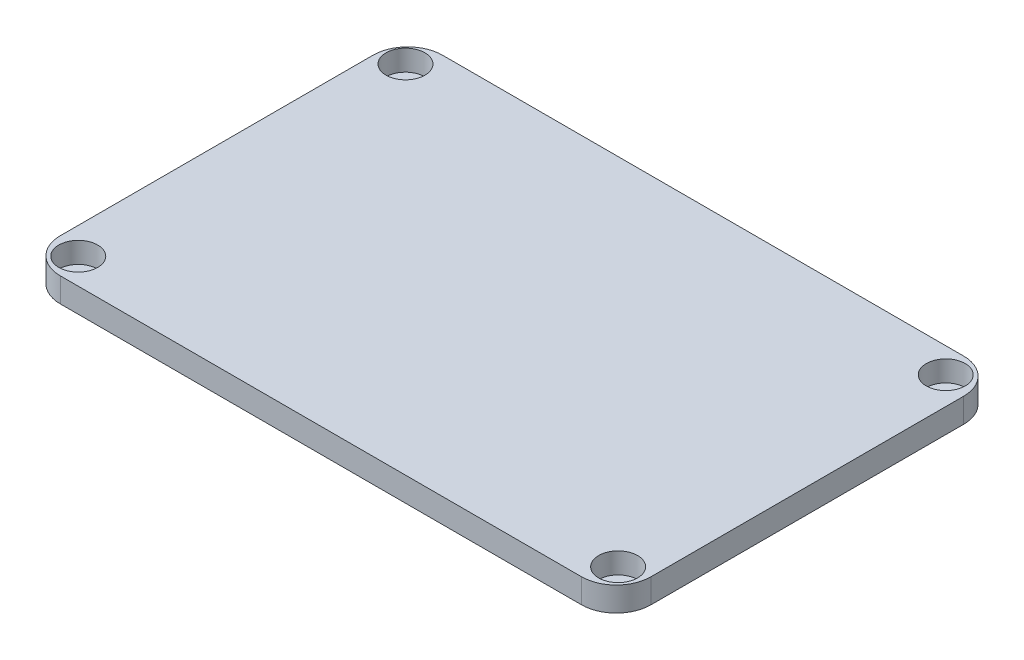
ISO-10303-21;
HEADER;
FILE_DESCRIPTION(('STEP AP214'),'2;1');
FILE_NAME('part.step','',(''),(''),'','','');
FILE_SCHEMA(('AUTOMOTIVE_DESIGN { 1 0 10303 214 1 1 1 1 }'));
ENDSEC;
DATA;
#1=APPLICATION_CONTEXT('core data for automotive mechanical design processes');
#2=APPLICATION_PROTOCOL_DEFINITION('international standard','automotive_design',2000,#1);
#3=PRODUCT_CONTEXT('',#1,'mechanical');
#4=PRODUCT('Part','Part','',(#3));
#5=PRODUCT_RELATED_PRODUCT_CATEGORY('part','',(#4));
#6=PRODUCT_DEFINITION_FORMATION('','',#4);
#7=PRODUCT_DEFINITION_CONTEXT('part definition',#1,'design');
#8=PRODUCT_DEFINITION('design','',#6,#7);
#9=PRODUCT_DEFINITION_SHAPE('','',#8);
#10=(LENGTH_UNIT() NAMED_UNIT(*) SI_UNIT(.MILLI.,.METRE.));
#11=(NAMED_UNIT(*) PLANE_ANGLE_UNIT() SI_UNIT($,.RADIAN.));
#12=(NAMED_UNIT(*) SI_UNIT($,.STERADIAN.) SOLID_ANGLE_UNIT());
#13=UNCERTAINTY_MEASURE_WITH_UNIT(LENGTH_MEASURE(1.E-05),#10,'distance_accuracy_value','');
#14=(GEOMETRIC_REPRESENTATION_CONTEXT(3) GLOBAL_UNCERTAINTY_ASSIGNED_CONTEXT((#13)) GLOBAL_UNIT_ASSIGNED_CONTEXT((#10,
#11,#12)) REPRESENTATION_CONTEXT('',''));
#15=CARTESIAN_POINT('',(0.,0.,0.));
#16=DIRECTION('',(0.,0.,1.));
#17=DIRECTION('',(1.,0.,0.));
#18=AXIS2_PLACEMENT_3D('',#15,#16,#17);
#19=CARTESIAN_POINT('',(54.3775100401606,3.5,42.4347389558233));
#20=DIRECTION('',(0.,-1.,0.));
#21=DIRECTION('',(0.,0.,-1.));
#22=AXIS2_PLACEMENT_3D('',#19,#20,#21);
#23=CYLINDRICAL_SURFACE('',#22,5.);
#24=CARTESIAN_POINT('',(54.3775100401606,0.,42.4347389558233));
#25=DIRECTION('',(0.,1.,0.));
#26=DIRECTION('',(0.,0.,1.));
#27=AXIS2_PLACEMENT_3D('',#24,#25,#26);
#28=CIRCLE('',#27,5.);
#29=CARTESIAN_POINT('',(54.3775100401606,0.,47.4347389558233));
#30=VERTEX_POINT('',#29);
#31=CARTESIAN_POINT('',(59.3775100401606,0.,42.4347389558233));
#32=VERTEX_POINT('',#31);
#33=EDGE_CURVE('E144',#30,#32,#28,.T.);
#34=ORIENTED_EDGE('',*,*,#33,.T.);
#35=DIRECTION('',(0.,-1.,0.));
#36=VECTOR('',#35,1.);
#37=CARTESIAN_POINT('',(59.3775100401606,3.5,42.4347389558233));
#38=LINE('',#37,#36);
#39=CARTESIAN_POINT('',(59.3775100401606,3.5,42.4347389558233));
#40=VERTEX_POINT('',#39);
#41=EDGE_CURVE('E11',#40,#32,#38,.T.);
#42=ORIENTED_EDGE('',*,*,#41,.F.);
#43=CARTESIAN_POINT('',(54.3775100401606,3.5,42.4347389558233));
#44=DIRECTION('',(0.,1.,0.));
#45=DIRECTION('',(0.,0.,1.));
#46=AXIS2_PLACEMENT_3D('',#43,#44,#45);
#47=CIRCLE('',#46,5.);
#48=CARTESIAN_POINT('',(54.3775100401606,3.5,47.4347389558233));
#49=VERTEX_POINT('',#48);
#50=EDGE_CURVE('E167',#49,#40,#47,.T.);
#51=ORIENTED_EDGE('',*,*,#50,.F.);
#52=DIRECTION('',(0.,-1.,0.));
#53=VECTOR('',#52,1.);
#54=CARTESIAN_POINT('',(54.3775100401606,3.5,47.4347389558233));
#55=LINE('',#54,#53);
#56=EDGE_CURVE('E140',#49,#30,#55,.T.);
#57=ORIENTED_EDGE('',*,*,#56,.T.);
#58=EDGE_LOOP('',(#34,#42,#51,#57));
#59=FACE_BOUND('',#58,.T.);
#60=ADVANCED_FACE('F43',(#59),#23,.T.);
#61=CARTESIAN_POINT('',(59.3775100401606,3.5,-2.56526104417667));
#62=DIRECTION('',(-1.,0.,0.));
#63=DIRECTION('',(0.,0.,1.));
#64=AXIS2_PLACEMENT_3D('',#61,#62,#63);
#65=PLANE('',#64);
#66=DIRECTION('',(0.,0.,-1.));
#67=VECTOR('',#66,1.);
#68=CARTESIAN_POINT('',(59.3775100401606,0.,-2.56526104417667));
#69=LINE('',#68,#67);
#70=CARTESIAN_POINT('',(59.3775100401606,0.,-2.56526104417667));
#71=VERTEX_POINT('',#70);
#72=EDGE_CURVE('E148',#32,#71,#69,.T.);
#73=ORIENTED_EDGE('',*,*,#72,.T.);
#74=DIRECTION('',(0.,-1.,0.));
#75=VECTOR('',#74,1.);
#76=CARTESIAN_POINT('',(59.3775100401606,3.5,-2.56526104417667));
#77=LINE('',#76,#75);
#78=CARTESIAN_POINT('',(59.3775100401606,3.5,-2.56526104417667));
#79=VERTEX_POINT('',#78);
#80=EDGE_CURVE('E52',#79,#71,#77,.T.);
#81=ORIENTED_EDGE('',*,*,#80,.F.);
#82=DIRECTION('',(0.,0.,-1.));
#83=VECTOR('',#82,1.);
#84=CARTESIAN_POINT('',(59.3775100401606,3.5,-2.56526104417667));
#85=LINE('',#84,#83);
#86=EDGE_CURVE('E103',#40,#79,#85,.T.);
#87=ORIENTED_EDGE('',*,*,#86,.F.);
#88=ORIENTED_EDGE('',*,*,#41,.T.);
#89=EDGE_LOOP('',(#73,#81,#87,#88));
#90=FACE_BOUND('',#89,.T.);
#91=ADVANCED_FACE('F266',(#90),#65,.F.);
#92=CARTESIAN_POINT('',(54.3775100401606,3.5,-2.56526104417671));
#93=DIRECTION('',(0.,-1.,0.));
#94=DIRECTION('',(0.,0.,-1.));
#95=AXIS2_PLACEMENT_3D('',#92,#93,#94);
#96=CYLINDRICAL_SURFACE('',#95,5.);
#97=CARTESIAN_POINT('',(54.3775100401606,0.,-2.56526104417671));
#98=DIRECTION('',(0.,1.,0.));
#99=DIRECTION('',(0.,0.,1.));
#100=AXIS2_PLACEMENT_3D('',#97,#98,#99);
#101=CIRCLE('',#100,5.);
#102=CARTESIAN_POINT('',(54.3775100401606,0.,-7.56526104417671));
#103=VERTEX_POINT('',#102);
#104=EDGE_CURVE('E152',#71,#103,#101,.T.);
#105=ORIENTED_EDGE('',*,*,#104,.T.);
#106=DIRECTION('',(0.,-1.,0.));
#107=VECTOR('',#106,1.);
#108=CARTESIAN_POINT('',(54.3775100401606,3.5,-7.56526104417671));
#109=LINE('',#108,#107);
#110=CARTESIAN_POINT('',(54.3775100401606,3.5,-7.56526104417671));
#111=VERTEX_POINT('',#110);
#112=EDGE_CURVE('E178',#111,#103,#109,.T.);
#113=ORIENTED_EDGE('',*,*,#112,.F.);
#114=CARTESIAN_POINT('',(54.3775100401606,3.5,-2.56526104417671));
#115=DIRECTION('',(0.,1.,0.));
#116=DIRECTION('',(0.,0.,1.));
#117=AXIS2_PLACEMENT_3D('',#114,#115,#116);
#118=CIRCLE('',#117,5.);
#119=EDGE_CURVE('E188',#79,#111,#118,.T.);
#120=ORIENTED_EDGE('',*,*,#119,.F.);
#121=ORIENTED_EDGE('',*,*,#80,.T.);
#122=EDGE_LOOP('',(#105,#113,#120,#121));
#123=FACE_BOUND('',#122,.T.);
#124=ADVANCED_FACE('F186',(#123),#96,.T.);
#125=CARTESIAN_POINT('',(-20.6224899598393,3.5,-7.56526104417671));
#126=DIRECTION('',(0.,0.,1.));
#127=DIRECTION('',(1.,0.,0.));
#128=AXIS2_PLACEMENT_3D('',#125,#126,#127);
#129=PLANE('',#128);
#130=DIRECTION('',(-1.,0.,0.));
#131=VECTOR('',#130,1.);
#132=CARTESIAN_POINT('',(-20.6224899598393,0.,-7.56526104417671));
#133=LINE('',#132,#131);
#134=CARTESIAN_POINT('',(-20.6224899598394,0.,-7.56526104417671));
#135=VERTEX_POINT('',#134);
#136=EDGE_CURVE('E155',#103,#135,#133,.T.);
#137=ORIENTED_EDGE('',*,*,#136,.T.);
#138=DIRECTION('',(0.,-1.,0.));
#139=VECTOR('',#138,1.);
#140=CARTESIAN_POINT('',(-20.6224899598394,3.5,-7.56526104417671));
#141=LINE('',#140,#139);
#142=CARTESIAN_POINT('',(-20.6224899598394,3.5,-7.56526104417671));
#143=VERTEX_POINT('',#142);
#144=EDGE_CURVE('E174',#143,#135,#141,.T.);
#145=ORIENTED_EDGE('',*,*,#144,.F.);
#146=DIRECTION('',(-1.,0.,0.));
#147=VECTOR('',#146,1.);
#148=CARTESIAN_POINT('',(-20.6224899598393,3.5,-7.56526104417671));
#149=LINE('',#148,#147);
#150=EDGE_CURVE('E201',#111,#143,#149,.T.);
#151=ORIENTED_EDGE('',*,*,#150,.F.);
#152=ORIENTED_EDGE('',*,*,#112,.T.);
#153=EDGE_LOOP('',(#137,#145,#151,#152));
#154=FACE_BOUND('',#153,.T.);
#155=ADVANCED_FACE('F196',(#154),#129,.F.);
#156=CARTESIAN_POINT('',(-20.6224899598394,3.5,-2.56526104417671));
#157=DIRECTION('',(0.,-1.,0.));
#158=DIRECTION('',(0.,0.,-1.));
#159=AXIS2_PLACEMENT_3D('',#156,#157,#158);
#160=CYLINDRICAL_SURFACE('',#159,5.);
#161=CARTESIAN_POINT('',(-20.6224899598394,0.,-2.56526104417671));
#162=DIRECTION('',(0.,1.,0.));
#163=DIRECTION('',(0.,0.,-1.));
#164=AXIS2_PLACEMENT_3D('',#161,#162,#163);
#165=CIRCLE('',#164,5.);
#166=CARTESIAN_POINT('',(-25.6224899598394,0.,-2.56526104417667));
#167=VERTEX_POINT('',#166);
#168=EDGE_CURVE('E158',#135,#167,#165,.T.);
#169=ORIENTED_EDGE('',*,*,#168,.T.);
#170=DIRECTION('',(0.,-1.,0.));
#171=VECTOR('',#170,1.);
#172=CARTESIAN_POINT('',(-25.6224899598394,3.5,-2.56526104417667));
#173=LINE('',#172,#171);
#174=CARTESIAN_POINT('',(-25.6224899598394,3.5,-2.56526104417667));
#175=VERTEX_POINT('',#174);
#176=EDGE_CURVE('E133',#175,#167,#173,.T.);
#177=ORIENTED_EDGE('',*,*,#176,.F.);
#178=CARTESIAN_POINT('',(-20.6224899598394,3.5,-2.56526104417671));
#179=DIRECTION('',(0.,1.,0.));
#180=DIRECTION('',(0.,0.,-1.));
#181=AXIS2_PLACEMENT_3D('',#178,#179,#180);
#182=CIRCLE('',#181,5.);
#183=EDGE_CURVE('E122',#143,#175,#182,.T.);
#184=ORIENTED_EDGE('',*,*,#183,.F.);
#185=ORIENTED_EDGE('',*,*,#144,.T.);
#186=EDGE_LOOP('',(#169,#177,#184,#185));
#187=FACE_BOUND('',#186,.T.);
#188=ADVANCED_FACE('F199',(#187),#160,.T.);
#189=CARTESIAN_POINT('',(-25.6224899598394,3.5,-2.56526104417667));
#190=DIRECTION('',(1.,0.,0.));
#191=DIRECTION('',(0.,0.,-1.));
#192=AXIS2_PLACEMENT_3D('',#189,#190,#191);
#193=PLANE('',#192);
#194=DIRECTION('',(0.,0.,1.));
#195=VECTOR('',#194,1.);
#196=CARTESIAN_POINT('',(-25.6224899598394,0.,-2.56526104417667));
#197=LINE('',#196,#195);
#198=CARTESIAN_POINT('',(-25.6224899598394,0.,42.4347389558233));
#199=VERTEX_POINT('',#198);
#200=EDGE_CURVE('E131',#167,#199,#197,.T.);
#201=ORIENTED_EDGE('',*,*,#200,.T.);
#202=DIRECTION('',(0.,-1.,0.));
#203=VECTOR('',#202,1.);
#204=CARTESIAN_POINT('',(-25.6224899598394,3.5,42.4347389558233));
#205=LINE('',#204,#203);
#206=CARTESIAN_POINT('',(-25.6224899598394,3.5,42.4347389558233));
#207=VERTEX_POINT('',#206);
#208=EDGE_CURVE('E128',#207,#199,#205,.T.);
#209=ORIENTED_EDGE('',*,*,#208,.F.);
#210=DIRECTION('',(0.,0.,1.));
#211=VECTOR('',#210,1.);
#212=CARTESIAN_POINT('',(-25.6224899598394,3.5,-2.56526104417667));
#213=LINE('',#212,#211);
#214=EDGE_CURVE('E116',#175,#207,#213,.T.);
#215=ORIENTED_EDGE('',*,*,#214,.F.);
#216=ORIENTED_EDGE('',*,*,#176,.T.);
#217=EDGE_LOOP('',(#201,#209,#215,#216));
#218=FACE_BOUND('',#217,.T.);
#219=ADVANCED_FACE('F129',(#218),#193,.F.);
#220=CARTESIAN_POINT('',(-20.6224899598394,3.5,42.4347389558233));
#221=DIRECTION('',(0.,-1.,0.));
#222=DIRECTION('',(0.,0.,-1.));
#223=AXIS2_PLACEMENT_3D('',#220,#221,#222);
#224=CYLINDRICAL_SURFACE('',#223,5.);
#225=CARTESIAN_POINT('',(-20.6224899598394,0.,42.4347389558233));
#226=DIRECTION('',(0.,1.,0.));
#227=DIRECTION('',(0.,0.,-1.));
#228=AXIS2_PLACEMENT_3D('',#225,#226,#227);
#229=CIRCLE('',#228,5.);
#230=CARTESIAN_POINT('',(-20.6224899598393,0.,47.4347389558233));
#231=VERTEX_POINT('',#230);
#232=EDGE_CURVE('E89',#199,#231,#229,.T.);
#233=ORIENTED_EDGE('',*,*,#232,.T.);
#234=DIRECTION('',(0.,-1.,0.));
#235=VECTOR('',#234,1.);
#236=CARTESIAN_POINT('',(-20.6224899598393,3.5,47.4347389558233));
#237=LINE('',#236,#235);
#238=CARTESIAN_POINT('',(-20.6224899598393,3.5,47.4347389558233));
#239=VERTEX_POINT('',#238);
#240=EDGE_CURVE('E134',#239,#231,#237,.T.);
#241=ORIENTED_EDGE('',*,*,#240,.F.);
#242=CARTESIAN_POINT('',(-20.6224899598394,3.5,42.4347389558233));
#243=DIRECTION('',(0.,1.,0.));
#244=DIRECTION('',(0.,0.,-1.));
#245=AXIS2_PLACEMENT_3D('',#242,#243,#244);
#246=CIRCLE('',#245,5.);
#247=EDGE_CURVE('E120',#207,#239,#246,.T.);
#248=ORIENTED_EDGE('',*,*,#247,.F.);
#249=ORIENTED_EDGE('',*,*,#208,.T.);
#250=EDGE_LOOP('',(#233,#241,#248,#249));
#251=FACE_BOUND('',#250,.T.);
#252=ADVANCED_FACE('F136',(#251),#224,.T.);
#253=CARTESIAN_POINT('',(-20.6224899598393,3.5,47.4347389558233));
#254=DIRECTION('',(0.,0.,-1.));
#255=DIRECTION('',(-1.,0.,0.));
#256=AXIS2_PLACEMENT_3D('',#253,#254,#255);
#257=PLANE('',#256);
#258=DIRECTION('',(1.,0.,0.));
#259=VECTOR('',#258,1.);
#260=CARTESIAN_POINT('',(-20.6224899598393,0.,47.4347389558233));
#261=LINE('',#260,#259);
#262=EDGE_CURVE('E95',#231,#30,#261,.T.);
#263=ORIENTED_EDGE('',*,*,#262,.T.);
#264=ORIENTED_EDGE('',*,*,#56,.F.);
#265=DIRECTION('',(1.,0.,0.));
#266=VECTOR('',#265,1.);
#267=CARTESIAN_POINT('',(-20.6224899598393,3.5,47.4347389558233));
#268=LINE('',#267,#266);
#269=EDGE_CURVE('E60',#239,#49,#268,.T.);
#270=ORIENTED_EDGE('',*,*,#269,.F.);
#271=ORIENTED_EDGE('',*,*,#240,.T.);
#272=EDGE_LOOP('',(#263,#264,#270,#271));
#273=FACE_BOUND('',#272,.T.);
#274=ADVANCED_FACE('F247',(#273),#257,.F.);
#275=CARTESIAN_POINT('',(54.3775100401606,3.5,42.4347389558233));
#276=DIRECTION('',(0.,1.,0.));
#277=DIRECTION('',(0.,0.,1.));
#278=AXIS2_PLACEMENT_3D('',#275,#276,#277);
#279=PLANE('',#278);
#280=CARTESIAN_POINT('',(-21.7754371988893,3.5,43.6972813848257));
#281=DIRECTION('',(0.,1.,0.));
#282=DIRECTION('',(0.,0.,1.));
#283=AXIS2_PLACEMENT_3D('',#280,#281,#282);
#284=CIRCLE('',#283,2.8);
#285=CARTESIAN_POINT('',(-21.7754371988893,3.5,46.4972813848257));
#286=VERTEX_POINT('',#285);
#287=EDGE_CURVE('E223',#286,#286,#284,.T.);
#288=ORIENTED_EDGE('',*,*,#287,.F.);
#289=EDGE_LOOP('',(#288));
#290=FACE_BOUND('',#289,.T.);
#291=CARTESIAN_POINT('',(55.7665058119681,3.5,43.5521346605813));
#292=DIRECTION('',(0.,1.,0.));
#293=DIRECTION('',(0.,0.,1.));
#294=AXIS2_PLACEMENT_3D('',#291,#292,#293);
#295=CIRCLE('',#294,2.8);
#296=CARTESIAN_POINT('',(55.7665058119681,3.5,46.3521346605813));
#297=VERTEX_POINT('',#296);
#298=EDGE_CURVE('E231',#297,#297,#295,.T.);
#299=ORIENTED_EDGE('',*,*,#298,.F.);
#300=EDGE_LOOP('',(#299));
#301=FACE_BOUND('',#300,.T.);
#302=CARTESIAN_POINT('',(55.4124330128318,3.5,-3.94786533941863));
#303=DIRECTION('',(0.,1.,0.));
#304=DIRECTION('',(0.,0.,1.));
#305=AXIS2_PLACEMENT_3D('',#302,#303,#304);
#306=CIRCLE('',#305,2.8);
#307=CARTESIAN_POINT('',(55.4124330128318,3.5,-1.14786533941863));
#308=VERTEX_POINT('',#307);
#309=EDGE_CURVE('E215',#308,#308,#306,.T.);
#310=ORIENTED_EDGE('',*,*,#309,.F.);
#311=EDGE_LOOP('',(#310));
#312=FACE_BOUND('',#311,.T.);
#313=CARTESIAN_POINT('',(-22.1875669871682,3.5,-3.8027186151743));
#314=DIRECTION('',(0.,1.,0.));
#315=DIRECTION('',(0.,0.,1.));
#316=AXIS2_PLACEMENT_3D('',#313,#314,#315);
#317=CIRCLE('',#316,2.8);
#318=CARTESIAN_POINT('',(-22.1875669871682,3.5,-1.0027186151743));
#319=VERTEX_POINT('',#318);
#320=EDGE_CURVE('E211',#319,#319,#317,.T.);
#321=ORIENTED_EDGE('',*,*,#320,.F.);
#322=EDGE_LOOP('',(#321));
#323=FACE_BOUND('',#322,.T.);
#324=ORIENTED_EDGE('',*,*,#50,.T.);
#325=ORIENTED_EDGE('',*,*,#86,.T.);
#326=ORIENTED_EDGE('',*,*,#119,.T.);
#327=ORIENTED_EDGE('',*,*,#150,.T.);
#328=ORIENTED_EDGE('',*,*,#183,.T.);
#329=ORIENTED_EDGE('',*,*,#214,.T.);
#330=ORIENTED_EDGE('',*,*,#247,.T.);
#331=ORIENTED_EDGE('',*,*,#269,.T.);
#332=EDGE_LOOP('',(#324,#325,#326,#327,#328,#329,#330,#331));
#333=FACE_BOUND('',#332,.T.);
#334=ADVANCED_FACE('F118',(#290,#301,#312,#323,#333),#279,.T.);
#335=CARTESIAN_POINT('',(54.3775100401606,0.,42.4347389558233));
#336=DIRECTION('',(0.,1.,0.));
#337=DIRECTION('',(0.,0.,1.));
#338=AXIS2_PLACEMENT_3D('',#335,#336,#337);
#339=PLANE('',#338);
#340=ORIENTED_EDGE('',*,*,#33,.F.);
#341=ORIENTED_EDGE('',*,*,#262,.F.);
#342=ORIENTED_EDGE('',*,*,#232,.F.);
#343=ORIENTED_EDGE('',*,*,#200,.F.);
#344=ORIENTED_EDGE('',*,*,#168,.F.);
#345=ORIENTED_EDGE('',*,*,#136,.F.);
#346=ORIENTED_EDGE('',*,*,#104,.F.);
#347=ORIENTED_EDGE('',*,*,#72,.F.);
#348=EDGE_LOOP('',(#340,#341,#342,#343,#344,#345,#346,#347));
#349=FACE_BOUND('',#348,.T.);
#350=ADVANCED_FACE('F192',(#349),#339,.F.);
#351=CARTESIAN_POINT('',(-22.1875669871682,0.5,-3.8027186151743));
#352=DIRECTION('',(0.,1.,0.));
#353=DIRECTION('',(0.,0.,1.));
#354=AXIS2_PLACEMENT_3D('',#351,#352,#353);
#355=CYLINDRICAL_SURFACE('',#354,2.8);
#356=CARTESIAN_POINT('',(-22.1875669871682,0.5,-3.8027186151743));
#357=DIRECTION('',(0.,1.,0.));
#358=DIRECTION('',(0.,0.,1.));
#359=AXIS2_PLACEMENT_3D('',#356,#357,#358);
#360=CIRCLE('',#359,2.8);
#361=CARTESIAN_POINT('',(-22.1875669871682,0.5,-1.0027186151743));
#362=VERTEX_POINT('',#361);
#363=EDGE_CURVE('E149',#362,#362,#360,.T.);
#364=ORIENTED_EDGE('',*,*,#363,.F.);
#365=EDGE_LOOP('',(#364));
#366=FACE_BOUND('',#365,.T.);
#367=ORIENTED_EDGE('',*,*,#320,.T.);
#368=EDGE_LOOP('',(#367));
#369=FACE_BOUND('',#368,.T.);
#370=ADVANCED_FACE('F252',(#366,#369),#355,.F.);
#371=CARTESIAN_POINT('',(-22.1875669871682,0.5,-3.8027186151743));
#372=DIRECTION('',(0.,1.,0.));
#373=DIRECTION('',(0.,0.,1.));
#374=AXIS2_PLACEMENT_3D('',#371,#372,#373);
#375=PLANE('',#374);
#376=ORIENTED_EDGE('',*,*,#363,.T.);
#377=EDGE_LOOP('',(#376));
#378=FACE_BOUND('',#377,.T.);
#379=ADVANCED_FACE('F254',(#378),#375,.T.);
#380=CARTESIAN_POINT('',(55.4124330128318,0.5,-3.94786533941863));
#381=DIRECTION('',(0.,1.,0.));
#382=DIRECTION('',(0.,0.,1.));
#383=AXIS2_PLACEMENT_3D('',#380,#381,#382);
#384=CYLINDRICAL_SURFACE('',#383,2.8);
#385=CARTESIAN_POINT('',(55.4124330128318,0.5,-3.94786533941863));
#386=DIRECTION('',(0.,1.,0.));
#387=DIRECTION('',(0.,0.,1.));
#388=AXIS2_PLACEMENT_3D('',#385,#386,#387);
#389=CIRCLE('',#388,2.8);
#390=CARTESIAN_POINT('',(55.4124330128318,0.5,-1.14786533941863));
#391=VERTEX_POINT('',#390);
#392=EDGE_CURVE('E235',#391,#391,#389,.T.);
#393=ORIENTED_EDGE('',*,*,#392,.F.);
#394=EDGE_LOOP('',(#393));
#395=FACE_BOUND('',#394,.T.);
#396=ORIENTED_EDGE('',*,*,#309,.T.);
#397=EDGE_LOOP('',(#396));
#398=FACE_BOUND('',#397,.T.);
#399=ADVANCED_FACE('F243',(#395,#398),#384,.F.);
#400=CARTESIAN_POINT('',(55.4124330128318,0.5,-3.94786533941863));
#401=DIRECTION('',(0.,1.,0.));
#402=DIRECTION('',(0.,0.,1.));
#403=AXIS2_PLACEMENT_3D('',#400,#401,#402);
#404=PLANE('',#403);
#405=ORIENTED_EDGE('',*,*,#392,.T.);
#406=EDGE_LOOP('',(#405));
#407=FACE_BOUND('',#406,.T.);
#408=ADVANCED_FACE('F348',(#407),#404,.T.);
#409=CARTESIAN_POINT('',(55.7665058119681,0.5,43.5521346605813));
#410=DIRECTION('',(0.,1.,0.));
#411=DIRECTION('',(0.,0.,1.));
#412=AXIS2_PLACEMENT_3D('',#409,#410,#411);
#413=CYLINDRICAL_SURFACE('',#412,2.8);
#414=CARTESIAN_POINT('',(55.7665058119681,0.5,43.5521346605813));
#415=DIRECTION('',(0.,1.,0.));
#416=DIRECTION('',(0.,0.,1.));
#417=AXIS2_PLACEMENT_3D('',#414,#415,#416);
#418=CIRCLE('',#417,2.8);
#419=CARTESIAN_POINT('',(55.7665058119681,0.5,46.3521346605813));
#420=VERTEX_POINT('',#419);
#421=EDGE_CURVE('E227',#420,#420,#418,.T.);
#422=ORIENTED_EDGE('',*,*,#421,.F.);
#423=EDGE_LOOP('',(#422));
#424=FACE_BOUND('',#423,.T.);
#425=ORIENTED_EDGE('',*,*,#298,.T.);
#426=EDGE_LOOP('',(#425));
#427=FACE_BOUND('',#426,.T.);
#428=ADVANCED_FACE('F359',(#424,#427),#413,.F.);
#429=CARTESIAN_POINT('',(55.7665058119681,0.5,43.5521346605813));
#430=DIRECTION('',(0.,1.,0.));
#431=DIRECTION('',(0.,0.,1.));
#432=AXIS2_PLACEMENT_3D('',#429,#430,#431);
#433=PLANE('',#432);
#434=ORIENTED_EDGE('',*,*,#421,.T.);
#435=EDGE_LOOP('',(#434));
#436=FACE_BOUND('',#435,.T.);
#437=ADVANCED_FACE('F370',(#436),#433,.T.);
#438=CARTESIAN_POINT('',(-21.7754371988893,0.5,43.6972813848257));
#439=DIRECTION('',(0.,1.,0.));
#440=DIRECTION('',(0.,0.,1.));
#441=AXIS2_PLACEMENT_3D('',#438,#439,#440);
#442=CYLINDRICAL_SURFACE('',#441,2.8);
#443=CARTESIAN_POINT('',(-21.7754371988893,0.5,43.6972813848257));
#444=DIRECTION('',(0.,1.,0.));
#445=DIRECTION('',(0.,0.,1.));
#446=AXIS2_PLACEMENT_3D('',#443,#444,#445);
#447=CIRCLE('',#446,2.8);
#448=CARTESIAN_POINT('',(-21.7754371988893,0.5,46.4972813848257));
#449=VERTEX_POINT('',#448);
#450=EDGE_CURVE('E219',#449,#449,#447,.T.);
#451=ORIENTED_EDGE('',*,*,#450,.F.);
#452=EDGE_LOOP('',(#451));
#453=FACE_BOUND('',#452,.T.);
#454=ORIENTED_EDGE('',*,*,#287,.T.);
#455=EDGE_LOOP('',(#454));
#456=FACE_BOUND('',#455,.T.);
#457=ADVANCED_FACE('F381',(#453,#456),#442,.F.);
#458=CARTESIAN_POINT('',(-21.7754371988893,0.5,43.6972813848257));
#459=DIRECTION('',(0.,1.,0.));
#460=DIRECTION('',(0.,0.,1.));
#461=AXIS2_PLACEMENT_3D('',#458,#459,#460);
#462=PLANE('',#461);
#463=ORIENTED_EDGE('',*,*,#450,.T.);
#464=EDGE_LOOP('',(#463));
#465=FACE_BOUND('',#464,.T.);
#466=ADVANCED_FACE('F392',(#465),#462,.T.);
#467=CLOSED_SHELL('',(#60,#91,#124,#155,#188,#219,#252,#274,#334,#350,#370,#379,#399,#408,#428,
#437,#457,#466));
#468=MANIFOLD_SOLID_BREP('B2',#467);
#469=ADVANCED_BREP_SHAPE_REPRESENTATION('',(#18,#468),#14);
#470=SHAPE_DEFINITION_REPRESENTATION(#9,#469);
ENDSEC;
END-ISO-10303-21;
